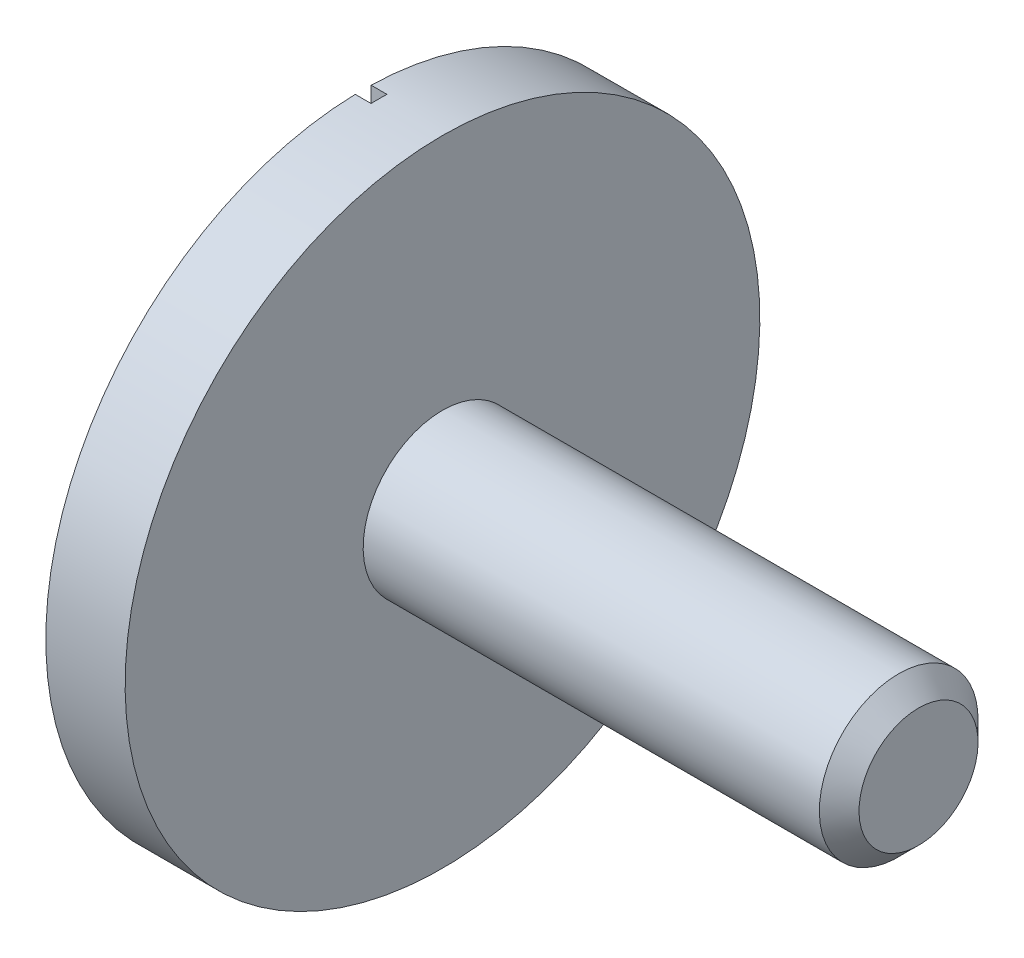
ISO-10303-21;
HEADER;
FILE_DESCRIPTION(('STEP AP214'),'2;1');
FILE_NAME('part.step','',(''),(''),'','','');
FILE_SCHEMA(('AUTOMOTIVE_DESIGN { 1 0 10303 214 1 1 1 1 }'));
ENDSEC;
DATA;
#1=APPLICATION_CONTEXT('core data for automotive mechanical design processes');
#2=APPLICATION_PROTOCOL_DEFINITION('international standard','automotive_design',2000,#1);
#3=PRODUCT_CONTEXT('',#1,'mechanical');
#4=PRODUCT('Part','Part','',(#3));
#5=PRODUCT_RELATED_PRODUCT_CATEGORY('part','',(#4));
#6=PRODUCT_DEFINITION_FORMATION('','',#4);
#7=PRODUCT_DEFINITION_CONTEXT('part definition',#1,'design');
#8=PRODUCT_DEFINITION('design','',#6,#7);
#9=PRODUCT_DEFINITION_SHAPE('','',#8);
#10=(LENGTH_UNIT() NAMED_UNIT(*) SI_UNIT(.MILLI.,.METRE.));
#11=(NAMED_UNIT(*) PLANE_ANGLE_UNIT() SI_UNIT($,.RADIAN.));
#12=(NAMED_UNIT(*) SI_UNIT($,.STERADIAN.) SOLID_ANGLE_UNIT());
#13=UNCERTAINTY_MEASURE_WITH_UNIT(LENGTH_MEASURE(1.E-05),#10,'distance_accuracy_value','');
#14=(GEOMETRIC_REPRESENTATION_CONTEXT(3) GLOBAL_UNCERTAINTY_ASSIGNED_CONTEXT((#13)) GLOBAL_UNIT_ASSIGNED_CONTEXT((#10,
#11,#12)) REPRESENTATION_CONTEXT('',''));
#15=CARTESIAN_POINT('',(0.,0.,0.));
#16=DIRECTION('',(0.,0.,1.));
#17=DIRECTION('',(1.,0.,0.));
#18=AXIS2_PLACEMENT_3D('',#15,#16,#17);
#19=CARTESIAN_POINT('',(0.,0.,0.));
#20=DIRECTION('',(-1.,0.,0.));
#21=DIRECTION('',(0.,-1.,0.));
#22=AXIS2_PLACEMENT_3D('',#19,#20,#21);
#23=PLANE('',#22);
#24=DIRECTION('',(0.,-1.,0.));
#25=VECTOR('',#24,1.);
#26=CARTESIAN_POINT('',(0.,1.99937490231322,-0.0499999999999999));
#27=LINE('',#26,#25);
#28=CARTESIAN_POINT('',(0.,1.99937490231322,-0.0499999999999995));
#29=VERTEX_POINT('',#28);
#30=CARTESIAN_POINT('',(0.,-1.99937490231322,-0.0499999999999999));
#31=VERTEX_POINT('',#30);
#32=EDGE_CURVE('E77',#29,#31,#27,.T.);
#33=ORIENTED_EDGE('',*,*,#32,.F.);
#34=CARTESIAN_POINT('',(0.,0.,0.));
#35=DIRECTION('',(1.,0.,0.));
#36=DIRECTION('',(0.,1.,0.));
#37=AXIS2_PLACEMENT_3D('',#34,#35,#36);
#38=CIRCLE('',#37,2.);
#39=EDGE_CURVE('E113',#31,#29,#38,.T.);
#40=ORIENTED_EDGE('',*,*,#39,.F.);
#41=EDGE_LOOP('',(#33,#40));
#42=FACE_BOUND('',#41,.T.);
#43=ADVANCED_FACE('F38',(#42),#23,.T.);
#44=DIRECTION('',(0.,1.,0.));
#45=VECTOR('',#44,1.);
#46=CARTESIAN_POINT('',(0.,1.99937490231322,0.0499999999999999));
#47=LINE('',#46,#45);
#48=CARTESIAN_POINT('',(0.,-1.99937490231322,0.0499999999999999));
#49=VERTEX_POINT('',#48);
#50=CARTESIAN_POINT('',(0.,1.99937490231322,0.0499999999999999));
#51=VERTEX_POINT('',#50);
#52=EDGE_CURVE('E234',#49,#51,#47,.T.);
#53=ORIENTED_EDGE('',*,*,#52,.F.);
#54=EDGE_CURVE('E99',#51,#49,#38,.T.);
#55=ORIENTED_EDGE('',*,*,#54,.F.);
#56=EDGE_LOOP('',(#53,#55));
#57=FACE_BOUND('',#56,.T.);
#58=ADVANCED_FACE('F131',(#57),#23,.T.);
#59=CARTESIAN_POINT('',(3.5,0.,0.));
#60=DIRECTION('',(1.,0.,0.));
#61=DIRECTION('',(0.,1.,0.));
#62=AXIS2_PLACEMENT_3D('',#59,#60,#61);
#63=CYLINDRICAL_SURFACE('',#62,2.);
#64=DIRECTION('',(-1.,0.,0.));
#65=VECTOR('',#64,1.);
#66=CARTESIAN_POINT('',(0.100000000000001,1.99937490231322,-0.0499999999999995));
#67=LINE('',#66,#65);
#68=CARTESIAN_POINT('',(0.100000000000001,1.99937490231322,-0.0499999999999995));
#69=VERTEX_POINT('',#68);
#70=EDGE_CURVE('E101',#69,#29,#67,.T.);
#71=ORIENTED_EDGE('',*,*,#70,.F.);
#72=CARTESIAN_POINT('',(0.1,0.,0.));
#73=DIRECTION('',(-1.,0.,0.));
#74=DIRECTION('',(0.,-1.,0.));
#75=AXIS2_PLACEMENT_3D('',#72,#73,#74);
#76=CIRCLE('',#75,2.);
#77=CARTESIAN_POINT('',(0.100000000000001,1.99937490231322,0.0499999999999999));
#78=VERTEX_POINT('',#77);
#79=EDGE_CURVE('E59',#78,#69,#76,.T.);
#80=ORIENTED_EDGE('',*,*,#79,.F.);
#81=DIRECTION('',(-1.,0.,0.));
#82=VECTOR('',#81,1.);
#83=CARTESIAN_POINT('',(0.100000000000001,1.99937490231322,0.0499999999999999));
#84=LINE('',#83,#82);
#85=EDGE_CURVE('E87',#78,#51,#84,.T.);
#86=ORIENTED_EDGE('',*,*,#85,.T.);
#87=ORIENTED_EDGE('',*,*,#54,.T.);
#88=DIRECTION('',(-1.,0.,0.));
#89=VECTOR('',#88,1.);
#90=CARTESIAN_POINT('',(0.0999999999999992,-1.99937490231322,0.0499999999999999));
#91=LINE('',#90,#89);
#92=CARTESIAN_POINT('',(0.0999999999999992,-1.99937490231322,0.0499999999999999));
#93=VERTEX_POINT('',#92);
#94=EDGE_CURVE('E84',#93,#49,#91,.T.);
#95=ORIENTED_EDGE('',*,*,#94,.F.);
#96=CARTESIAN_POINT('',(0.1,0.,0.));
#97=DIRECTION('',(-1.,0.,0.));
#98=DIRECTION('',(0.,-1.,0.));
#99=AXIS2_PLACEMENT_3D('',#96,#97,#98);
#100=CIRCLE('',#99,2.);
#101=CARTESIAN_POINT('',(0.099999999999999,-1.99937490231322,-0.0499999999999999));
#102=VERTEX_POINT('',#101);
#103=EDGE_CURVE('E88',#102,#93,#100,.T.);
#104=ORIENTED_EDGE('',*,*,#103,.F.);
#105=DIRECTION('',(-1.,0.,0.));
#106=VECTOR('',#105,1.);
#107=CARTESIAN_POINT('',(0.0999999999999992,-1.99937490231322,-0.0499999999999999));
#108=LINE('',#107,#106);
#109=EDGE_CURVE('E110',#102,#31,#108,.T.);
#110=ORIENTED_EDGE('',*,*,#109,.T.);
#111=ORIENTED_EDGE('',*,*,#39,.T.);
#112=EDGE_LOOP('',(#71,#80,#86,#87,#95,#104,#110,#111));
#113=FACE_BOUND('',#112,.T.);
#114=CARTESIAN_POINT('',(0.5,0.,0.));
#115=DIRECTION('',(1.,0.,0.));
#116=DIRECTION('',(0.,1.,0.));
#117=AXIS2_PLACEMENT_3D('',#114,#115,#116);
#118=CIRCLE('',#117,2.);
#119=CARTESIAN_POINT('',(0.5,2.,0.));
#120=VERTEX_POINT('',#119);
#121=EDGE_CURVE('E109',#120,#120,#118,.T.);
#122=ORIENTED_EDGE('',*,*,#121,.F.);
#123=EDGE_LOOP('',(#122));
#124=FACE_BOUND('',#123,.T.);
#125=ADVANCED_FACE('F96',(#113,#124),#63,.T.);
#126=CARTESIAN_POINT('',(0.5,2.,0.));
#127=DIRECTION('',(1.,0.,0.));
#128=DIRECTION('',(0.,1.,0.));
#129=AXIS2_PLACEMENT_3D('',#126,#127,#128);
#130=PLANE('',#129);
#131=ORIENTED_EDGE('',*,*,#121,.T.);
#132=EDGE_LOOP('',(#131));
#133=FACE_BOUND('',#132,.T.);
#134=CARTESIAN_POINT('',(0.5,0.,0.));
#135=DIRECTION('',(1.,0.,0.));
#136=DIRECTION('',(0.,1.,0.));
#137=AXIS2_PLACEMENT_3D('',#134,#135,#136);
#138=CIRCLE('',#137,0.5);
#139=CARTESIAN_POINT('',(0.5,0.5,0.));
#140=VERTEX_POINT('',#139);
#141=EDGE_CURVE('E106',#140,#140,#138,.T.);
#142=ORIENTED_EDGE('',*,*,#141,.F.);
#143=EDGE_LOOP('',(#142));
#144=FACE_BOUND('',#143,.T.);
#145=ADVANCED_FACE('F140',(#133,#144),#130,.T.);
#146=CARTESIAN_POINT('',(3.5,0.,0.));
#147=DIRECTION('',(1.,0.,0.));
#148=DIRECTION('',(0.,1.,0.));
#149=AXIS2_PLACEMENT_3D('',#146,#147,#148);
#150=CYLINDRICAL_SURFACE('',#149,0.5);
#151=CARTESIAN_POINT('',(3.375,0.,0.));
#152=DIRECTION('',(1.,0.,0.));
#153=DIRECTION('',(0.,1.,0.));
#154=AXIS2_PLACEMENT_3D('',#151,#152,#153);
#155=CIRCLE('',#154,0.5);
#156=CARTESIAN_POINT('',(3.375,0.5,0.));
#157=VERTEX_POINT('',#156);
#158=EDGE_CURVE('E11',#157,#157,#155,.F.);
#159=ORIENTED_EDGE('',*,*,#158,.T.);
#160=EDGE_LOOP('',(#159));
#161=FACE_BOUND('',#160,.T.);
#162=ORIENTED_EDGE('',*,*,#141,.T.);
#163=EDGE_LOOP('',(#162));
#164=FACE_BOUND('',#163,.T.);
#165=ADVANCED_FACE('F127',(#161,#164),#150,.T.);
#166=CARTESIAN_POINT('',(3.5,0.,0.));
#167=DIRECTION('',(1.,0.,0.));
#168=DIRECTION('',(0.,1.,0.));
#169=AXIS2_PLACEMENT_3D('',#166,#167,#168);
#170=PLANE('',#169);
#171=CARTESIAN_POINT('',(3.5,0.,0.));
#172=DIRECTION('',(1.,0.,0.));
#173=DIRECTION('',(0.,1.,0.));
#174=AXIS2_PLACEMENT_3D('',#171,#172,#173);
#175=CIRCLE('',#174,0.374999999999999);
#176=CARTESIAN_POINT('',(3.5,0.375,0.));
#177=VERTEX_POINT('',#176);
#178=EDGE_CURVE('E46',#177,#177,#175,.T.);
#179=ORIENTED_EDGE('',*,*,#178,.T.);
#180=EDGE_LOOP('',(#179));
#181=FACE_BOUND('',#180,.T.);
#182=ADVANCED_FACE('F117',(#181),#170,.T.);
#183=CARTESIAN_POINT('',(3.5,0.,0.));
#184=DIRECTION('',(-1.,0.,0.));
#185=DIRECTION('',(0.,-1.,0.));
#186=AXIS2_PLACEMENT_3D('',#183,#184,#185);
#187=CONICAL_SURFACE('',#186,0.374999999999999,0.785398163397445);
#188=ORIENTED_EDGE('',*,*,#158,.F.);
#189=EDGE_LOOP('',(#188));
#190=FACE_BOUND('',#189,.T.);
#191=ORIENTED_EDGE('',*,*,#178,.F.);
#192=EDGE_LOOP('',(#191));
#193=FACE_BOUND('',#192,.T.);
#194=ADVANCED_FACE('F40',(#190,#193),#187,.T.);
#195=CARTESIAN_POINT('',(0.100000000000001,1.99937490231322,-0.0499999999999999));
#196=DIRECTION('',(0.,0.,-1.));
#197=DIRECTION('',(-1.,0.,0.));
#198=AXIS2_PLACEMENT_3D('',#195,#196,#197);
#199=PLANE('',#198);
#200=ORIENTED_EDGE('',*,*,#32,.T.);
#201=ORIENTED_EDGE('',*,*,#109,.F.);
#202=DIRECTION('',(0.,-1.,0.));
#203=VECTOR('',#202,1.);
#204=CARTESIAN_POINT('',(0.100000000000001,1.99937490231322,-0.0499999999999999));
#205=LINE('',#204,#203);
#206=EDGE_CURVE('E53',#69,#102,#205,.T.);
#207=ORIENTED_EDGE('',*,*,#206,.F.);
#208=ORIENTED_EDGE('',*,*,#70,.T.);
#209=EDGE_LOOP('',(#200,#201,#207,#208));
#210=FACE_BOUND('',#209,.T.);
#211=ADVANCED_FACE('F120',(#210),#199,.F.);
#212=CARTESIAN_POINT('',(0.100000000000001,1.99937490231322,0.0499999999999999));
#213=DIRECTION('',(0.,0.,1.));
#214=DIRECTION('',(1.,0.,0.));
#215=AXIS2_PLACEMENT_3D('',#212,#213,#214);
#216=PLANE('',#215);
#217=ORIENTED_EDGE('',*,*,#52,.T.);
#218=ORIENTED_EDGE('',*,*,#85,.F.);
#219=DIRECTION('',(0.,1.,0.));
#220=VECTOR('',#219,1.);
#221=CARTESIAN_POINT('',(0.100000000000001,1.99937490231322,0.0499999999999999));
#222=LINE('',#221,#220);
#223=EDGE_CURVE('E81',#93,#78,#222,.T.);
#224=ORIENTED_EDGE('',*,*,#223,.F.);
#225=ORIENTED_EDGE('',*,*,#94,.T.);
#226=EDGE_LOOP('',(#217,#218,#224,#225));
#227=FACE_BOUND('',#226,.T.);
#228=ADVANCED_FACE('F82',(#227),#216,.F.);
#229=CARTESIAN_POINT('',(0.1,0.,0.));
#230=DIRECTION('',(-1.,0.,0.));
#231=DIRECTION('',(0.,-1.,0.));
#232=AXIS2_PLACEMENT_3D('',#229,#230,#231);
#233=PLANE('',#232);
#234=ORIENTED_EDGE('',*,*,#103,.T.);
#235=ORIENTED_EDGE('',*,*,#223,.T.);
#236=ORIENTED_EDGE('',*,*,#79,.T.);
#237=ORIENTED_EDGE('',*,*,#206,.T.);
#238=EDGE_LOOP('',(#234,#235,#236,#237));
#239=FACE_BOUND('',#238,.T.);
#240=ADVANCED_FACE('F91',(#239),#233,.T.);
#241=CLOSED_SHELL('',(#43,#58,#125,#145,#165,#182,#194,#211,#228,#240));
#242=MANIFOLD_SOLID_BREP('B2',#241);
#243=ADVANCED_BREP_SHAPE_REPRESENTATION('',(#18,#242),#14);
#244=SHAPE_DEFINITION_REPRESENTATION(#9,#243);
ENDSEC;
END-ISO-10303-21;
